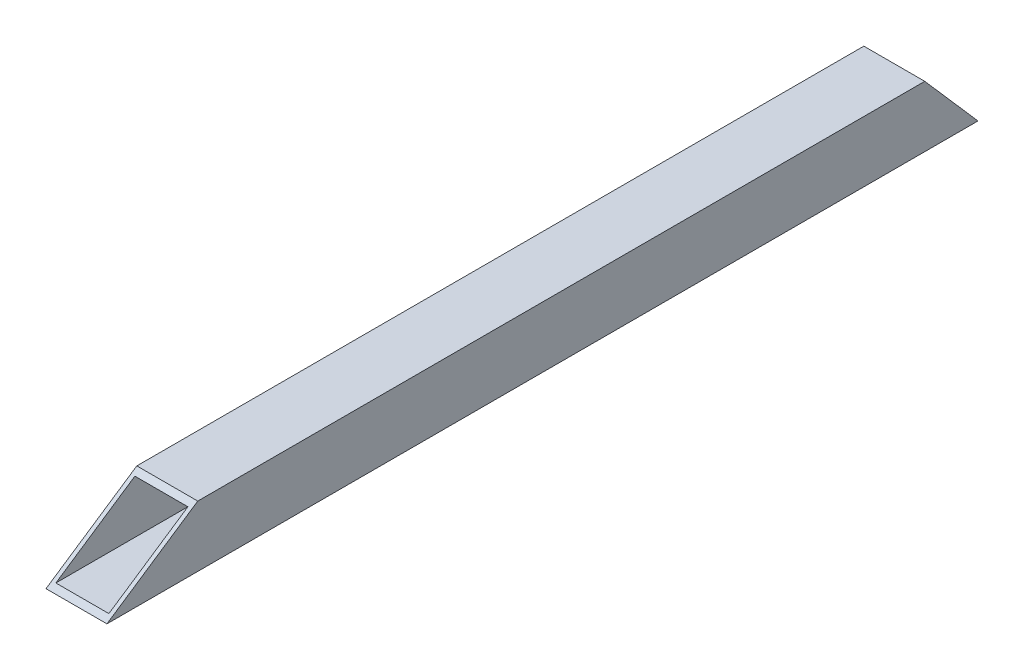
ISO-10303-21;
HEADER;
FILE_DESCRIPTION(('STEP AP214'),'2;1');
FILE_NAME('part.step','',(''),(''),'','','');
FILE_SCHEMA(('AUTOMOTIVE_DESIGN { 1 0 10303 214 1 1 1 1 }'));
ENDSEC;
DATA;
#1=APPLICATION_CONTEXT('core data for automotive mechanical design processes');
#2=APPLICATION_PROTOCOL_DEFINITION('international standard','automotive_design',2000,#1);
#3=PRODUCT_CONTEXT('',#1,'mechanical');
#4=PRODUCT('Part','Part','',(#3));
#5=PRODUCT_RELATED_PRODUCT_CATEGORY('part','',(#4));
#6=PRODUCT_DEFINITION_FORMATION('','',#4);
#7=PRODUCT_DEFINITION_CONTEXT('part definition',#1,'design');
#8=PRODUCT_DEFINITION('design','',#6,#7);
#9=PRODUCT_DEFINITION_SHAPE('','',#8);
#10=(LENGTH_UNIT() NAMED_UNIT(*) SI_UNIT(.MILLI.,.METRE.));
#11=(NAMED_UNIT(*) PLANE_ANGLE_UNIT() SI_UNIT($,.RADIAN.));
#12=(NAMED_UNIT(*) SI_UNIT($,.STERADIAN.) SOLID_ANGLE_UNIT());
#13=UNCERTAINTY_MEASURE_WITH_UNIT(LENGTH_MEASURE(1.E-05),#10,'distance_accuracy_value','');
#14=(GEOMETRIC_REPRESENTATION_CONTEXT(3) GLOBAL_UNCERTAINTY_ASSIGNED_CONTEXT((#13)) GLOBAL_UNIT_ASSIGNED_CONTEXT((#10,
#11,#12)) REPRESENTATION_CONTEXT('',''));
#15=CARTESIAN_POINT('',(0.,0.,0.));
#16=DIRECTION('',(0.,0.,1.));
#17=DIRECTION('',(1.,0.,0.));
#18=AXIS2_PLACEMENT_3D('',#15,#16,#17);
#19=CARTESIAN_POINT('',(-12.7,12.7,365.442998740068));
#20=DIRECTION('',(1.,0.,0.));
#21=DIRECTION('',(0.,0.,-1.));
#22=AXIS2_PLACEMENT_3D('',#19,#20,#21);
#23=PLANE('',#22);
#24=DIRECTION('',(0.,0.,-1.));
#25=VECTOR('',#24,1.);
#26=CARTESIAN_POINT('',(-12.7,12.7,365.442998740068));
#27=LINE('',#26,#25);
#28=CARTESIAN_POINT('',(-12.6999999999997,12.7,325.232406187078));
#29=VERTEX_POINT('',#28);
#30=CARTESIAN_POINT('',(-12.7,12.7,22.1886957106137));
#31=VERTEX_POINT('',#30);
#32=EDGE_CURVE('E117',#29,#31,#27,.T.);
#33=ORIENTED_EDGE('',*,*,#32,.T.);
#34=DIRECTION('',(0.,0.753109895855487,0.657894736842101));
#35=VECTOR('',#34,1.);
#36=CARTESIAN_POINT('',(-12.7,-12.7,0.));
#37=LINE('',#36,#35);
#38=CARTESIAN_POINT('',(-12.7,-12.7,0.));
#39=VERTEX_POINT('',#38);
#40=EDGE_CURVE('E47',#39,#31,#37,.T.);
#41=ORIENTED_EDGE('',*,*,#40,.F.);
#42=DIRECTION('',(0.,0.,-1.));
#43=VECTOR('',#42,1.);
#44=CARTESIAN_POINT('',(-12.7,-12.7,365.442998740068));
#45=LINE('',#44,#43);
#46=CARTESIAN_POINT('',(-12.6999999999998,-12.7,363.087957238757));
#47=VERTEX_POINT('',#46);
#48=EDGE_CURVE('E111',#47,#39,#45,.T.);
#49=ORIENTED_EDGE('',*,*,#48,.F.);
#50=DIRECTION('',(0.,0.557172610873235,-0.830396701398014));
#51=VECTOR('',#50,1.);
#52=CARTESIAN_POINT('',(-12.6999999999998,-13.7896171738,364.711896551733));
#53=LINE('',#52,#51);
#54=EDGE_CURVE('E148',#47,#29,#53,.T.);
#55=ORIENTED_EDGE('',*,*,#54,.T.);
#56=EDGE_LOOP('',(#33,#41,#49,#55));
#57=FACE_BOUND('',#56,.T.);
#58=ADVANCED_FACE('F33',(#57),#23,.F.);
#59=CARTESIAN_POINT('',(12.7,-12.7,365.442998740068));
#60=DIRECTION('',(0.,1.,0.));
#61=DIRECTION('',(-1.,0.,0.));
#62=AXIS2_PLACEMENT_3D('',#59,#60,#61);
#63=PLANE('',#62);
#64=DIRECTION('',(0.,0.,-1.));
#65=VECTOR('',#64,1.);
#66=CARTESIAN_POINT('',(12.7,-12.7,365.442998740068));
#67=LINE('',#66,#65);
#68=CARTESIAN_POINT('',(12.7000000000002,-12.7,363.087957238757));
#69=VERTEX_POINT('',#68);
#70=CARTESIAN_POINT('',(12.7000000000002,-12.7,0.));
#71=VERTEX_POINT('',#70);
#72=EDGE_CURVE('E106',#69,#71,#67,.T.);
#73=ORIENTED_EDGE('',*,*,#72,.F.);
#74=DIRECTION('',(-1.,0.,0.));
#75=VECTOR('',#74,1.);
#76=CARTESIAN_POINT('',(12.7,-12.7,363.087957238757));
#77=LINE('',#76,#75);
#78=EDGE_CURVE('E153',#69,#47,#77,.T.);
#79=ORIENTED_EDGE('',*,*,#78,.T.);
#80=ORIENTED_EDGE('',*,*,#48,.T.);
#81=DIRECTION('',(1.,0.,0.));
#82=VECTOR('',#81,1.);
#83=CARTESIAN_POINT('',(12.7,-12.7,0.));
#84=LINE('',#83,#82);
#85=EDGE_CURVE('E98',#39,#71,#84,.T.);
#86=ORIENTED_EDGE('',*,*,#85,.T.);
#87=EDGE_LOOP('',(#73,#79,#80,#86));
#88=FACE_BOUND('',#87,.T.);
#89=ADVANCED_FACE('F115',(#88),#63,.F.);
#90=CARTESIAN_POINT('',(12.7,12.7,365.442998740068));
#91=DIRECTION('',(-1.,0.,0.));
#92=DIRECTION('',(0.,-1.,0.));
#93=AXIS2_PLACEMENT_3D('',#90,#91,#92);
#94=PLANE('',#93);
#95=ORIENTED_EDGE('',*,*,#72,.T.);
#96=DIRECTION('',(0.,0.753109895855487,0.657894736842101));
#97=VECTOR('',#96,1.);
#98=CARTESIAN_POINT('',(12.7000000000002,-12.7,0.));
#99=LINE('',#98,#97);
#100=CARTESIAN_POINT('',(12.7000000000001,12.7,22.1886957106137));
#101=VERTEX_POINT('',#100);
#102=EDGE_CURVE('E94',#71,#101,#99,.T.);
#103=ORIENTED_EDGE('',*,*,#102,.T.);
#104=DIRECTION('',(0.,0.,-1.));
#105=VECTOR('',#104,1.);
#106=CARTESIAN_POINT('',(12.7,12.7,365.442998740068));
#107=LINE('',#106,#105);
#108=CARTESIAN_POINT('',(12.7,12.7,325.232406187078));
#109=VERTEX_POINT('',#108);
#110=EDGE_CURVE('E112',#109,#101,#107,.T.);
#111=ORIENTED_EDGE('',*,*,#110,.F.);
#112=DIRECTION('',(0.,0.557172610873235,-0.830396701398014));
#113=VECTOR('',#112,1.);
#114=CARTESIAN_POINT('',(12.7000000000002,-13.7896171738,364.711896551733));
#115=LINE('',#114,#113);
#116=EDGE_CURVE('E108',#69,#109,#115,.T.);
#117=ORIENTED_EDGE('',*,*,#116,.F.);
#118=EDGE_LOOP('',(#95,#103,#111,#117));
#119=FACE_BOUND('',#118,.T.);
#120=ADVANCED_FACE('F107',(#119),#94,.F.);
#121=CARTESIAN_POINT('',(12.7,12.7,365.442998740068));
#122=DIRECTION('',(0.,-1.,0.));
#123=DIRECTION('',(1.,0.,0.));
#124=AXIS2_PLACEMENT_3D('',#121,#122,#123);
#125=PLANE('',#124);
#126=ORIENTED_EDGE('',*,*,#110,.T.);
#127=DIRECTION('',(-1.,0.,0.));
#128=VECTOR('',#127,1.);
#129=CARTESIAN_POINT('',(12.7000000000001,12.7,22.1886957106137));
#130=LINE('',#129,#128);
#131=EDGE_CURVE('E99',#101,#31,#130,.T.);
#132=ORIENTED_EDGE('',*,*,#131,.T.);
#133=ORIENTED_EDGE('',*,*,#32,.F.);
#134=DIRECTION('',(1.,0.,0.));
#135=VECTOR('',#134,1.);
#136=CARTESIAN_POINT('',(12.7,12.7,325.232406187078));
#137=LINE('',#136,#135);
#138=EDGE_CURVE('E157',#29,#109,#137,.T.);
#139=ORIENTED_EDGE('',*,*,#138,.T.);
#140=EDGE_LOOP('',(#126,#132,#133,#139));
#141=FACE_BOUND('',#140,.T.);
#142=ADVANCED_FACE('F179',(#141),#125,.F.);
#143=CARTESIAN_POINT('',(-11.049,11.049,365.442998740068));
#144=DIRECTION('',(1.,0.,0.));
#145=DIRECTION('',(0.,1.,0.));
#146=AXIS2_PLACEMENT_3D('',#143,#144,#145);
#147=PLANE('',#146);
#148=DIRECTION('',(0.,-0.753109895855487,-0.657894736842101));
#149=VECTOR('',#148,1.);
#150=CARTESIAN_POINT('',(-11.049,181.834787248016,169.939889739181));
#151=LINE('',#150,#149);
#152=CARTESIAN_POINT('',(-11.049,11.049,20.7464304894238));
#153=VERTEX_POINT('',#152);
#154=CARTESIAN_POINT('',(-11.049,-11.049,1.44226522118989));
#155=VERTEX_POINT('',#154);
#156=EDGE_CURVE('E166',#153,#155,#151,.T.);
#157=ORIENTED_EDGE('',*,*,#156,.F.);
#158=DIRECTION('',(0.,0.,-1.));
#159=VECTOR('',#158,1.);
#160=CARTESIAN_POINT('',(-11.049,11.049,365.442998740068));
#161=LINE('',#160,#159);
#162=CARTESIAN_POINT('',(-11.049,11.049,327.693017005437));
#163=VERTEX_POINT('',#162);
#164=EDGE_CURVE('E151',#163,#153,#161,.T.);
#165=ORIENTED_EDGE('',*,*,#164,.F.);
#166=DIRECTION('',(0.,0.557172610873235,-0.830396701398014));
#167=VECTOR('',#166,1.);
#168=CARTESIAN_POINT('',(-11.049,-6.41694630531996,353.723844644293));
#169=LINE('',#168,#167);
#170=CARTESIAN_POINT('',(-11.049,-11.049,360.627346420398));
#171=VERTEX_POINT('',#170);
#172=EDGE_CURVE('E136',#171,#163,#169,.T.);
#173=ORIENTED_EDGE('',*,*,#172,.F.);
#174=DIRECTION('',(0.,0.,-1.));
#175=VECTOR('',#174,1.);
#176=CARTESIAN_POINT('',(-11.049,-11.049,365.442998740068));
#177=LINE('',#176,#175);
#178=EDGE_CURVE('E118',#171,#155,#177,.T.);
#179=ORIENTED_EDGE('',*,*,#178,.T.);
#180=EDGE_LOOP('',(#157,#165,#173,#179));
#181=FACE_BOUND('',#180,.T.);
#182=ADVANCED_FACE('F177',(#181),#147,.T.);
#183=CARTESIAN_POINT('',(11.049,-11.049,365.442998740068));
#184=DIRECTION('',(0.,1.,0.));
#185=DIRECTION('',(-1.,0.,0.));
#186=AXIS2_PLACEMENT_3D('',#183,#184,#185);
#187=PLANE('',#186);
#188=DIRECTION('',(1.,0.,0.));
#189=VECTOR('',#188,1.);
#190=CARTESIAN_POINT('',(11.0490000000001,-11.049,1.4422652211899));
#191=LINE('',#190,#189);
#192=CARTESIAN_POINT('',(11.049,-11.049,1.44226522118987));
#193=VERTEX_POINT('',#192);
#194=EDGE_CURVE('E168',#155,#193,#191,.T.);
#195=ORIENTED_EDGE('',*,*,#194,.F.);
#196=ORIENTED_EDGE('',*,*,#178,.F.);
#197=DIRECTION('',(-1.,0.,0.));
#198=VECTOR('',#197,1.);
#199=CARTESIAN_POINT('',(11.049,-11.049,360.627346420398));
#200=LINE('',#199,#198);
#201=CARTESIAN_POINT('',(11.049,-11.049,360.627346420398));
#202=VERTEX_POINT('',#201);
#203=EDGE_CURVE('E147',#202,#171,#200,.T.);
#204=ORIENTED_EDGE('',*,*,#203,.F.);
#205=DIRECTION('',(0.,0.,-1.));
#206=VECTOR('',#205,1.);
#207=CARTESIAN_POINT('',(11.049,-11.049,365.442998740068));
#208=LINE('',#207,#206);
#209=EDGE_CURVE('E123',#202,#193,#208,.T.);
#210=ORIENTED_EDGE('',*,*,#209,.T.);
#211=EDGE_LOOP('',(#195,#196,#204,#210));
#212=FACE_BOUND('',#211,.T.);
#213=ADVANCED_FACE('F175',(#212),#187,.T.);
#214=CARTESIAN_POINT('',(11.049,11.049,365.442998740068));
#215=DIRECTION('',(-1.,0.,0.));
#216=DIRECTION('',(0.,-1.,0.));
#217=AXIS2_PLACEMENT_3D('',#214,#215,#216);
#218=PLANE('',#217);
#219=DIRECTION('',(0.,0.753109895855487,0.657894736842101));
#220=VECTOR('',#219,1.);
#221=CARTESIAN_POINT('',(11.049,181.834787248016,169.939889739181));
#222=LINE('',#221,#220);
#223=CARTESIAN_POINT('',(11.049,11.049,20.7464304894238));
#224=VERTEX_POINT('',#223);
#225=EDGE_CURVE('E54',#193,#224,#222,.T.);
#226=ORIENTED_EDGE('',*,*,#225,.F.);
#227=ORIENTED_EDGE('',*,*,#209,.F.);
#228=DIRECTION('',(0.,-0.557172610873235,0.830396701398014));
#229=VECTOR('',#228,1.);
#230=CARTESIAN_POINT('',(11.049,-6.41694630531996,353.723844644293));
#231=LINE('',#230,#229);
#232=CARTESIAN_POINT('',(11.049,11.049,327.693017005437));
#233=VERTEX_POINT('',#232);
#234=EDGE_CURVE('E133',#233,#202,#231,.T.);
#235=ORIENTED_EDGE('',*,*,#234,.F.);
#236=DIRECTION('',(0.,0.,-1.));
#237=VECTOR('',#236,1.);
#238=CARTESIAN_POINT('',(11.049,11.049,365.442998740068));
#239=LINE('',#238,#237);
#240=EDGE_CURVE('E145',#233,#224,#239,.T.);
#241=ORIENTED_EDGE('',*,*,#240,.T.);
#242=EDGE_LOOP('',(#226,#227,#235,#241));
#243=FACE_BOUND('',#242,.T.);
#244=ADVANCED_FACE('F144',(#243),#218,.T.);
#245=CARTESIAN_POINT('',(11.049,11.049,365.442998740068));
#246=DIRECTION('',(0.,-1.,0.));
#247=DIRECTION('',(1.,0.,0.));
#248=AXIS2_PLACEMENT_3D('',#245,#246,#247);
#249=PLANE('',#248);
#250=DIRECTION('',(-1.,0.,0.));
#251=VECTOR('',#250,1.);
#252=CARTESIAN_POINT('',(11.0490000000001,11.049,20.7464304894238));
#253=LINE('',#252,#251);
#254=EDGE_CURVE('E11',#224,#153,#253,.T.);
#255=ORIENTED_EDGE('',*,*,#254,.F.);
#256=ORIENTED_EDGE('',*,*,#240,.F.);
#257=DIRECTION('',(1.,0.,0.));
#258=VECTOR('',#257,1.);
#259=CARTESIAN_POINT('',(11.049,11.049,327.693017005437));
#260=LINE('',#259,#258);
#261=EDGE_CURVE('E40',#163,#233,#260,.T.);
#262=ORIENTED_EDGE('',*,*,#261,.F.);
#263=ORIENTED_EDGE('',*,*,#164,.T.);
#264=EDGE_LOOP('',(#255,#256,#262,#263));
#265=FACE_BOUND('',#264,.T.);
#266=ADVANCED_FACE('F150',(#265),#249,.T.);
#267=CARTESIAN_POINT('',(12.7000000000002,-13.7896171738,364.711896551733));
#268=DIRECTION('',(0.,-0.830396701398014,-0.557172610873235));
#269=DIRECTION('',(0.,0.557172610873235,-0.830396701398014));
#270=AXIS2_PLACEMENT_3D('',#267,#268,#269);
#271=PLANE('',#270);
#272=ORIENTED_EDGE('',*,*,#172,.T.);
#273=ORIENTED_EDGE('',*,*,#261,.T.);
#274=ORIENTED_EDGE('',*,*,#234,.T.);
#275=ORIENTED_EDGE('',*,*,#203,.T.);
#276=EDGE_LOOP('',(#272,#273,#274,#275));
#277=FACE_BOUND('',#276,.T.);
#278=ORIENTED_EDGE('',*,*,#116,.T.);
#279=ORIENTED_EDGE('',*,*,#138,.F.);
#280=ORIENTED_EDGE('',*,*,#54,.F.);
#281=ORIENTED_EDGE('',*,*,#78,.F.);
#282=EDGE_LOOP('',(#278,#279,#280,#281));
#283=FACE_BOUND('',#282,.T.);
#284=ADVANCED_FACE('F131',(#277,#283),#271,.F.);
#285=CARTESIAN_POINT('',(12.7000000000002,-12.7,0.));
#286=DIRECTION('',(0.,-0.657894736842101,0.753109895855487));
#287=DIRECTION('',(0.,-0.753109895855487,-0.657894736842101));
#288=AXIS2_PLACEMENT_3D('',#285,#286,#287);
#289=PLANE('',#288);
#290=ORIENTED_EDGE('',*,*,#156,.T.);
#291=ORIENTED_EDGE('',*,*,#194,.T.);
#292=ORIENTED_EDGE('',*,*,#225,.T.);
#293=ORIENTED_EDGE('',*,*,#254,.T.);
#294=EDGE_LOOP('',(#290,#291,#292,#293));
#295=FACE_BOUND('',#294,.T.);
#296=ORIENTED_EDGE('',*,*,#102,.F.);
#297=ORIENTED_EDGE('',*,*,#85,.F.);
#298=ORIENTED_EDGE('',*,*,#40,.T.);
#299=ORIENTED_EDGE('',*,*,#131,.F.);
#300=EDGE_LOOP('',(#296,#297,#298,#299));
#301=FACE_BOUND('',#300,.T.);
#302=ADVANCED_FACE('F96',(#295,#301),#289,.F.);
#303=CLOSED_SHELL('',(#58,#89,#120,#142,#182,#213,#244,#266,#284,#302));
#304=MANIFOLD_SOLID_BREP('B2',#303);
#305=ADVANCED_BREP_SHAPE_REPRESENTATION('',(#18,#304),#14);
#306=SHAPE_DEFINITION_REPRESENTATION(#9,#305);
ENDSEC;
END-ISO-10303-21;
